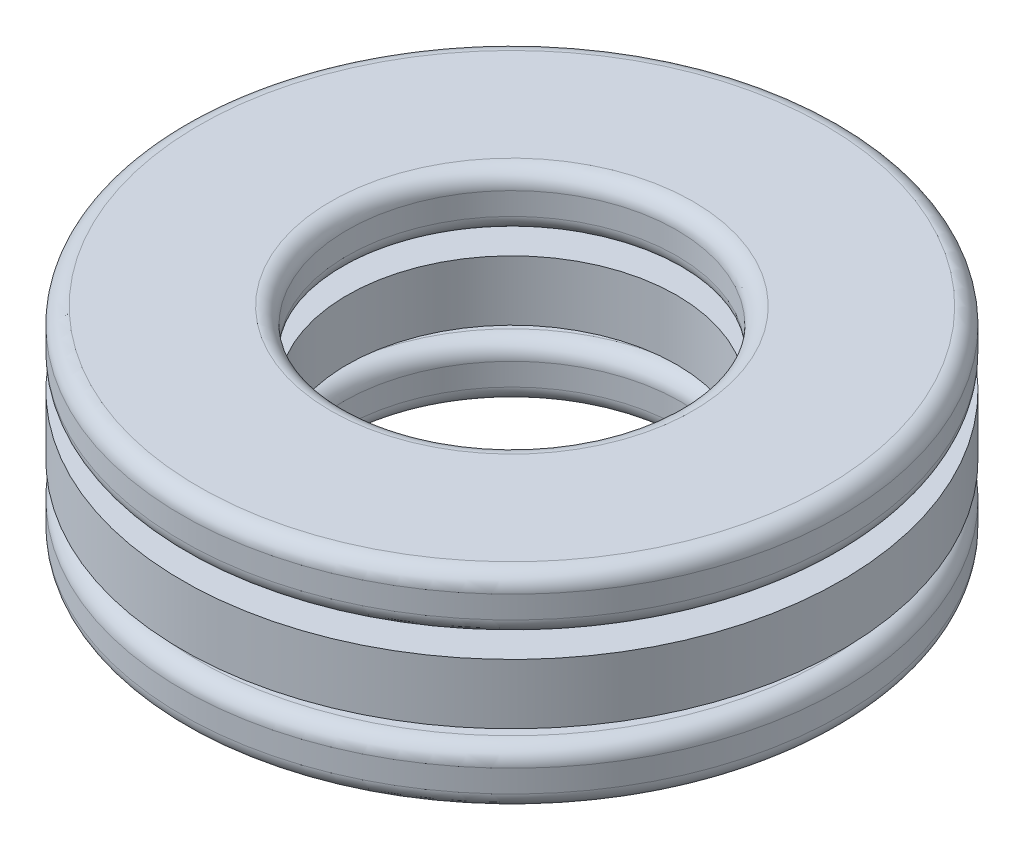
ISO-10303-21;
HEADER;
FILE_DESCRIPTION(('STEP AP214'),'2;1');
FILE_NAME('part.step','',(''),(''),'','','');
FILE_SCHEMA(('AUTOMOTIVE_DESIGN { 1 0 10303 214 1 1 1 1 }'));
ENDSEC;
DATA;
#1=APPLICATION_CONTEXT('core data for automotive mechanical design processes');
#2=APPLICATION_PROTOCOL_DEFINITION('international standard','automotive_design',2000,#1);
#3=PRODUCT_CONTEXT('',#1,'mechanical');
#4=PRODUCT('Part','Part','',(#3));
#5=PRODUCT_RELATED_PRODUCT_CATEGORY('part','',(#4));
#6=PRODUCT_DEFINITION_FORMATION('','',#4);
#7=PRODUCT_DEFINITION_CONTEXT('part definition',#1,'design');
#8=PRODUCT_DEFINITION('design','',#6,#7);
#9=PRODUCT_DEFINITION_SHAPE('','',#8);
#10=(LENGTH_UNIT() NAMED_UNIT(*) SI_UNIT(.MILLI.,.METRE.));
#11=(NAMED_UNIT(*) PLANE_ANGLE_UNIT() SI_UNIT($,.RADIAN.));
#12=(NAMED_UNIT(*) SI_UNIT($,.STERADIAN.) SOLID_ANGLE_UNIT());
#13=UNCERTAINTY_MEASURE_WITH_UNIT(LENGTH_MEASURE(1.E-05),#10,'distance_accuracy_value','');
#14=(GEOMETRIC_REPRESENTATION_CONTEXT(3) GLOBAL_UNCERTAINTY_ASSIGNED_CONTEXT((#13)) GLOBAL_UNIT_ASSIGNED_CONTEXT((#10,
#11,#12)) REPRESENTATION_CONTEXT('',''));
#15=CARTESIAN_POINT('',(0.,0.,0.));
#16=DIRECTION('',(0.,0.,1.));
#17=DIRECTION('',(1.,0.,0.));
#18=AXIS2_PLACEMENT_3D('',#15,#16,#17);
#19=CARTESIAN_POINT('',(0.,-1.55833333333333,0.));
#20=DIRECTION('',(0.,-1.,0.));
#21=DIRECTION('',(0.,0.,-1.));
#22=AXIS2_PLACEMENT_3D('',#19,#20,#21);
#23=TOROIDAL_SURFACE('',#22,4.5,0.4);
#24=CARTESIAN_POINT('',(0.,-1.15833333333333,0.));
#25=DIRECTION('',(0.,-1.,0.));
#26=DIRECTION('',(0.,0.,-1.));
#27=AXIS2_PLACEMENT_3D('',#24,#25,#26);
#28=CIRCLE('',#27,4.5);
#29=CARTESIAN_POINT('',(0.,-1.15833333333333,-4.5));
#30=VERTEX_POINT('',#29);
#31=EDGE_CURVE('E67',#30,#30,#28,.T.);
#32=ORIENTED_EDGE('',*,*,#31,.F.);
#33=EDGE_LOOP('',(#32));
#34=FACE_BOUND('',#33,.T.);
#35=CARTESIAN_POINT('',(0.,-1.55833333333333,0.));
#36=DIRECTION('',(0.,-1.,0.));
#37=DIRECTION('',(0.,0.,-1.));
#38=AXIS2_PLACEMENT_3D('',#35,#36,#37);
#39=CIRCLE('',#38,4.1);
#40=CARTESIAN_POINT('',(0.,-1.55833333333333,-4.1));
#41=VERTEX_POINT('',#40);
#42=EDGE_CURVE('E11',#41,#41,#39,.T.);
#43=ORIENTED_EDGE('',*,*,#42,.T.);
#44=EDGE_LOOP('',(#43));
#45=FACE_BOUND('',#44,.T.);
#46=ADVANCED_FACE('F39',(#34,#45),#23,.T.);
#47=CARTESIAN_POINT('',(0.,-3.5,0.));
#48=DIRECTION('',(0.,-1.,0.));
#49=DIRECTION('',(0.,0.,-1.));
#50=AXIS2_PLACEMENT_3D('',#47,#48,#49);
#51=CYLINDRICAL_SURFACE('',#50,4.1);
#52=ORIENTED_EDGE('',*,*,#42,.F.);
#53=EDGE_LOOP('',(#52));
#54=FACE_BOUND('',#53,.T.);
#55=CARTESIAN_POINT('',(0.,-2.1,0.));
#56=DIRECTION('',(0.,-1.,0.));
#57=DIRECTION('',(0.,0.,-1.));
#58=AXIS2_PLACEMENT_3D('',#55,#56,#57);
#59=CIRCLE('',#58,4.1);
#60=CARTESIAN_POINT('',(0.,-2.1,-4.1));
#61=VERTEX_POINT('',#60);
#62=EDGE_CURVE('E45',#61,#61,#59,.T.);
#63=ORIENTED_EDGE('',*,*,#62,.T.);
#64=EDGE_LOOP('',(#63));
#65=FACE_BOUND('',#64,.T.);
#66=ADVANCED_FACE('F74',(#54,#65),#51,.F.);
#67=CARTESIAN_POINT('',(0.,-2.1,0.));
#68=DIRECTION('',(0.,-1.,0.));
#69=DIRECTION('',(0.,0.,-1.));
#70=AXIS2_PLACEMENT_3D('',#67,#68,#69);
#71=TOROIDAL_SURFACE('',#70,4.5,0.400000000000002);
#72=ORIENTED_EDGE('',*,*,#62,.F.);
#73=EDGE_LOOP('',(#72));
#74=FACE_BOUND('',#73,.T.);
#75=CARTESIAN_POINT('',(0.,-2.5,0.));
#76=DIRECTION('',(0.,-1.,0.));
#77=DIRECTION('',(0.,0.,-1.));
#78=AXIS2_PLACEMENT_3D('',#75,#76,#77);
#79=CIRCLE('',#78,4.5);
#80=CARTESIAN_POINT('',(0.,-2.5,-4.5));
#81=VERTEX_POINT('',#80);
#82=EDGE_CURVE('E49',#81,#81,#79,.T.);
#83=ORIENTED_EDGE('',*,*,#82,.T.);
#84=EDGE_LOOP('',(#83));
#85=FACE_BOUND('',#84,.T.);
#86=ADVANCED_FACE('F78',(#74,#85),#71,.T.);
#87=CARTESIAN_POINT('',(0.,-2.5,7.6));
#88=DIRECTION('',(0.,1.,0.));
#89=DIRECTION('',(0.,0.,1.));
#90=AXIS2_PLACEMENT_3D('',#87,#88,#89);
#91=PLANE('',#90);
#92=ORIENTED_EDGE('',*,*,#82,.F.);
#93=EDGE_LOOP('',(#92));
#94=FACE_BOUND('',#93,.T.);
#95=CARTESIAN_POINT('',(0.,-2.5,0.));
#96=DIRECTION('',(0.,-1.,0.));
#97=DIRECTION('',(0.,0.,-1.));
#98=AXIS2_PLACEMENT_3D('',#95,#96,#97);
#99=CIRCLE('',#98,7.6);
#100=CARTESIAN_POINT('',(0.,-2.5,-7.6));
#101=VERTEX_POINT('',#100);
#102=EDGE_CURVE('E53',#101,#101,#99,.T.);
#103=ORIENTED_EDGE('',*,*,#102,.T.);
#104=EDGE_LOOP('',(#103));
#105=FACE_BOUND('',#104,.T.);
#106=ADVANCED_FACE('F83',(#94,#105),#91,.F.);
#107=CARTESIAN_POINT('',(0.,-2.1,0.));
#108=DIRECTION('',(0.,-1.,0.));
#109=DIRECTION('',(0.,0.,-1.));
#110=AXIS2_PLACEMENT_3D('',#107,#108,#109);
#111=TOROIDAL_SURFACE('',#110,7.6,0.400000000000001);
#112=ORIENTED_EDGE('',*,*,#102,.F.);
#113=EDGE_LOOP('',(#112));
#114=FACE_BOUND('',#113,.T.);
#115=CARTESIAN_POINT('',(0.,-2.1,0.));
#116=DIRECTION('',(0.,-1.,0.));
#117=DIRECTION('',(0.,0.,-1.));
#118=AXIS2_PLACEMENT_3D('',#115,#116,#117);
#119=CIRCLE('',#118,8.);
#120=CARTESIAN_POINT('',(0.,-2.1,-8.));
#121=VERTEX_POINT('',#120);
#122=EDGE_CURVE('E58',#121,#121,#119,.T.);
#123=ORIENTED_EDGE('',*,*,#122,.T.);
#124=EDGE_LOOP('',(#123));
#125=FACE_BOUND('',#124,.T.);
#126=ADVANCED_FACE('F89',(#114,#125),#111,.T.);
#127=CARTESIAN_POINT('',(0.,-3.5,0.));
#128=DIRECTION('',(0.,-1.,0.));
#129=DIRECTION('',(0.,0.,-1.));
#130=AXIS2_PLACEMENT_3D('',#127,#128,#129);
#131=CYLINDRICAL_SURFACE('',#130,8.);
#132=ORIENTED_EDGE('',*,*,#122,.F.);
#133=EDGE_LOOP('',(#132));
#134=FACE_BOUND('',#133,.T.);
#135=CARTESIAN_POINT('',(0.,-1.55833333333333,0.));
#136=DIRECTION('',(0.,-1.,0.));
#137=DIRECTION('',(0.,0.,-1.));
#138=AXIS2_PLACEMENT_3D('',#135,#136,#137);
#139=CIRCLE('',#138,8.);
#140=CARTESIAN_POINT('',(0.,-1.55833333333333,-8.));
#141=VERTEX_POINT('',#140);
#142=EDGE_CURVE('E61',#141,#141,#139,.T.);
#143=ORIENTED_EDGE('',*,*,#142,.T.);
#144=EDGE_LOOP('',(#143));
#145=FACE_BOUND('',#144,.T.);
#146=ADVANCED_FACE('F93',(#134,#145),#131,.T.);
#147=CARTESIAN_POINT('',(0.,-1.55833333333333,0.));
#148=DIRECTION('',(0.,-1.,0.));
#149=DIRECTION('',(0.,0.,-1.));
#150=AXIS2_PLACEMENT_3D('',#147,#148,#149);
#151=TOROIDAL_SURFACE('',#150,7.6,0.4);
#152=ORIENTED_EDGE('',*,*,#142,.F.);
#153=EDGE_LOOP('',(#152));
#154=FACE_BOUND('',#153,.T.);
#155=CARTESIAN_POINT('',(0.,-1.15833333333333,0.));
#156=DIRECTION('',(0.,-1.,0.));
#157=DIRECTION('',(0.,0.,-1.));
#158=AXIS2_PLACEMENT_3D('',#155,#156,#157);
#159=CIRCLE('',#158,7.6);
#160=CARTESIAN_POINT('',(0.,-1.15833333333333,-7.6));
#161=VERTEX_POINT('',#160);
#162=EDGE_CURVE('E64',#161,#161,#159,.T.);
#163=ORIENTED_EDGE('',*,*,#162,.T.);
#164=EDGE_LOOP('',(#163));
#165=FACE_BOUND('',#164,.T.);
#166=ADVANCED_FACE('F97',(#154,#165),#151,.T.);
#167=CARTESIAN_POINT('',(0.,-1.15833333333333,7.6));
#168=DIRECTION('',(0.,-1.,0.));
#169=DIRECTION('',(0.,0.,-1.));
#170=AXIS2_PLACEMENT_3D('',#167,#168,#169);
#171=PLANE('',#170);
#172=ORIENTED_EDGE('',*,*,#162,.F.);
#173=EDGE_LOOP('',(#172));
#174=FACE_BOUND('',#173,.T.);
#175=ORIENTED_EDGE('',*,*,#31,.T.);
#176=EDGE_LOOP('',(#175));
#177=FACE_BOUND('',#176,.T.);
#178=ADVANCED_FACE('F71',(#174,#177),#171,.F.);
#179=CLOSED_SHELL('',(#46,#66,#86,#106,#126,#146,#166,#178));
#180=MANIFOLD_SOLID_BREP('B2',#179);
#181=CARTESIAN_POINT('',(0.,1.55833333333333,0.));
#182=DIRECTION('',(0.,-1.,0.));
#183=DIRECTION('',(0.,0.,-1.));
#184=AXIS2_PLACEMENT_3D('',#181,#182,#183);
#185=TOROIDAL_SURFACE('',#184,4.4,0.400000000000001);
#186=CARTESIAN_POINT('',(0.,1.55833333333333,0.));
#187=DIRECTION('',(0.,-1.,0.));
#188=DIRECTION('',(0.,0.,-1.));
#189=AXIS2_PLACEMENT_3D('',#186,#187,#188);
#190=CIRCLE('',#189,4.);
#191=CARTESIAN_POINT('',(0.,1.55833333333333,-4.));
#192=VERTEX_POINT('',#191);
#193=EDGE_CURVE('E38',#192,#192,#190,.T.);
#194=ORIENTED_EDGE('',*,*,#193,.F.);
#195=EDGE_LOOP('',(#194));
#196=FACE_BOUND('',#195,.T.);
#197=CARTESIAN_POINT('',(0.,1.15833333333333,0.));
#198=DIRECTION('',(0.,-1.,0.));
#199=DIRECTION('',(0.,0.,-1.));
#200=AXIS2_PLACEMENT_3D('',#197,#198,#199);
#201=CIRCLE('',#200,4.4);
#202=CARTESIAN_POINT('',(0.,1.15833333333333,-4.4));
#203=VERTEX_POINT('',#202);
#204=EDGE_CURVE('E194',#203,#203,#201,.T.);
#205=ORIENTED_EDGE('',*,*,#204,.T.);
#206=EDGE_LOOP('',(#205));
#207=FACE_BOUND('',#206,.T.);
#208=ADVANCED_FACE('F166',(#196,#207),#185,.T.);
#209=CARTESIAN_POINT('',(0.,-3.5,0.));
#210=DIRECTION('',(0.,-1.,0.));
#211=DIRECTION('',(0.,0.,-1.));
#212=AXIS2_PLACEMENT_3D('',#209,#210,#211);
#213=CYLINDRICAL_SURFACE('',#212,4.);
#214=CARTESIAN_POINT('',(0.,2.1,0.));
#215=DIRECTION('',(0.,-1.,0.));
#216=DIRECTION('',(0.,0.,-1.));
#217=AXIS2_PLACEMENT_3D('',#214,#215,#216);
#218=CIRCLE('',#217,4.);
#219=CARTESIAN_POINT('',(0.,2.1,-4.));
#220=VERTEX_POINT('',#219);
#221=EDGE_CURVE('E172',#220,#220,#218,.T.);
#222=ORIENTED_EDGE('',*,*,#221,.F.);
#223=EDGE_LOOP('',(#222));
#224=FACE_BOUND('',#223,.T.);
#225=ORIENTED_EDGE('',*,*,#193,.T.);
#226=EDGE_LOOP('',(#225));
#227=FACE_BOUND('',#226,.T.);
#228=ADVANCED_FACE('F231',(#224,#227),#213,.F.);
#229=CARTESIAN_POINT('',(0.,2.1,0.));
#230=DIRECTION('',(0.,-1.,0.));
#231=DIRECTION('',(0.,0.,-1.));
#232=AXIS2_PLACEMENT_3D('',#229,#230,#231);
#233=TOROIDAL_SURFACE('',#232,4.4,0.4);
#234=CARTESIAN_POINT('',(0.,2.5,0.));
#235=DIRECTION('',(0.,-1.,0.));
#236=DIRECTION('',(0.,0.,-1.));
#237=AXIS2_PLACEMENT_3D('',#234,#235,#236);
#238=CIRCLE('',#237,4.4);
#239=CARTESIAN_POINT('',(0.,2.5,-4.4));
#240=VERTEX_POINT('',#239);
#241=EDGE_CURVE('E176',#240,#240,#238,.T.);
#242=ORIENTED_EDGE('',*,*,#241,.F.);
#243=EDGE_LOOP('',(#242));
#244=FACE_BOUND('',#243,.T.);
#245=ORIENTED_EDGE('',*,*,#221,.T.);
#246=EDGE_LOOP('',(#245));
#247=FACE_BOUND('',#246,.T.);
#248=ADVANCED_FACE('F226',(#244,#247),#233,.T.);
#249=CARTESIAN_POINT('',(0.,2.5,7.6));
#250=DIRECTION('',(0.,-1.,0.));
#251=DIRECTION('',(0.,0.,-1.));
#252=AXIS2_PLACEMENT_3D('',#249,#250,#251);
#253=PLANE('',#252);
#254=CARTESIAN_POINT('',(0.,2.5,0.));
#255=DIRECTION('',(0.,-1.,0.));
#256=DIRECTION('',(0.,0.,-1.));
#257=AXIS2_PLACEMENT_3D('',#254,#255,#256);
#258=CIRCLE('',#257,7.6);
#259=CARTESIAN_POINT('',(0.,2.5,-7.6));
#260=VERTEX_POINT('',#259);
#261=EDGE_CURVE('E180',#260,#260,#258,.T.);
#262=ORIENTED_EDGE('',*,*,#261,.F.);
#263=EDGE_LOOP('',(#262));
#264=FACE_BOUND('',#263,.T.);
#265=ORIENTED_EDGE('',*,*,#241,.T.);
#266=EDGE_LOOP('',(#265));
#267=FACE_BOUND('',#266,.T.);
#268=ADVANCED_FACE('F220',(#264,#267),#253,.F.);
#269=CARTESIAN_POINT('',(0.,2.1,0.));
#270=DIRECTION('',(0.,-1.,0.));
#271=DIRECTION('',(0.,0.,-1.));
#272=AXIS2_PLACEMENT_3D('',#269,#270,#271);
#273=TOROIDAL_SURFACE('',#272,7.6,0.400000000000001);
#274=CARTESIAN_POINT('',(0.,2.1,0.));
#275=DIRECTION('',(0.,-1.,0.));
#276=DIRECTION('',(0.,0.,-1.));
#277=AXIS2_PLACEMENT_3D('',#274,#275,#276);
#278=CIRCLE('',#277,8.);
#279=CARTESIAN_POINT('',(0.,2.1,-8.));
#280=VERTEX_POINT('',#279);
#281=EDGE_CURVE('E185',#280,#280,#278,.T.);
#282=ORIENTED_EDGE('',*,*,#281,.F.);
#283=EDGE_LOOP('',(#282));
#284=FACE_BOUND('',#283,.T.);
#285=ORIENTED_EDGE('',*,*,#261,.T.);
#286=EDGE_LOOP('',(#285));
#287=FACE_BOUND('',#286,.T.);
#288=ADVANCED_FACE('F214',(#284,#287),#273,.T.);
#289=CARTESIAN_POINT('',(0.,-3.5,0.));
#290=DIRECTION('',(0.,-1.,0.));
#291=DIRECTION('',(0.,0.,-1.));
#292=AXIS2_PLACEMENT_3D('',#289,#290,#291);
#293=CYLINDRICAL_SURFACE('',#292,8.);
#294=CARTESIAN_POINT('',(0.,1.55833333333333,0.));
#295=DIRECTION('',(0.,-1.,0.));
#296=DIRECTION('',(0.,0.,-1.));
#297=AXIS2_PLACEMENT_3D('',#294,#295,#296);
#298=CIRCLE('',#297,8.);
#299=CARTESIAN_POINT('',(0.,1.55833333333333,-8.));
#300=VERTEX_POINT('',#299);
#301=EDGE_CURVE('E188',#300,#300,#298,.T.);
#302=ORIENTED_EDGE('',*,*,#301,.F.);
#303=EDGE_LOOP('',(#302));
#304=FACE_BOUND('',#303,.T.);
#305=ORIENTED_EDGE('',*,*,#281,.T.);
#306=EDGE_LOOP('',(#305));
#307=FACE_BOUND('',#306,.T.);
#308=ADVANCED_FACE('F208',(#304,#307),#293,.T.);
#309=CARTESIAN_POINT('',(0.,1.55833333333333,0.));
#310=DIRECTION('',(0.,-1.,0.));
#311=DIRECTION('',(0.,0.,-1.));
#312=AXIS2_PLACEMENT_3D('',#309,#310,#311);
#313=TOROIDAL_SURFACE('',#312,7.6,0.4);
#314=CARTESIAN_POINT('',(0.,1.15833333333333,0.));
#315=DIRECTION('',(0.,-1.,0.));
#316=DIRECTION('',(0.,0.,-1.));
#317=AXIS2_PLACEMENT_3D('',#314,#315,#316);
#318=CIRCLE('',#317,7.6);
#319=CARTESIAN_POINT('',(0.,1.15833333333333,-7.6));
#320=VERTEX_POINT('',#319);
#321=EDGE_CURVE('E191',#320,#320,#318,.T.);
#322=ORIENTED_EDGE('',*,*,#321,.F.);
#323=EDGE_LOOP('',(#322));
#324=FACE_BOUND('',#323,.T.);
#325=ORIENTED_EDGE('',*,*,#301,.T.);
#326=EDGE_LOOP('',(#325));
#327=FACE_BOUND('',#326,.T.);
#328=ADVANCED_FACE('F202',(#324,#327),#313,.T.);
#329=CARTESIAN_POINT('',(0.,1.15833333333333,7.6));
#330=DIRECTION('',(0.,1.,0.));
#331=DIRECTION('',(0.,0.,1.));
#332=AXIS2_PLACEMENT_3D('',#329,#330,#331);
#333=PLANE('',#332);
#334=ORIENTED_EDGE('',*,*,#204,.F.);
#335=EDGE_LOOP('',(#334));
#336=FACE_BOUND('',#335,.T.);
#337=ORIENTED_EDGE('',*,*,#321,.T.);
#338=EDGE_LOOP('',(#337));
#339=FACE_BOUND('',#338,.T.);
#340=ADVANCED_FACE('F199',(#336,#339),#333,.F.);
#341=CLOSED_SHELL('',(#208,#228,#248,#268,#288,#308,#328,#340));
#342=MANIFOLD_SOLID_BREP('B6',#341);
#343=CARTESIAN_POINT('',(-5.1961524227066,0.,3.00000000000006));
#344=DIRECTION('',(0.,1.,0.));
#345=DIRECTION('',(0.866025403784433,0.,-0.50000000000001));
#346=AXIS2_PLACEMENT_3D('',#343,#344,#345);
#347=SPHERICAL_SURFACE('',#346,1.16666666666667);
#348=CARTESIAN_POINT('',(-5.1961524227066,1.16666666666667,3.00000000000006));
#349=VERTEX_POINT('',#348);
#350=VERTEX_LOOP('',#349);
#351=FACE_BOUND('',#350,.T.);
#352=ADVANCED_FACE('F293',(#351),#347,.T.);
#353=CLOSED_SHELL('',(#352));
#354=MANIFOLD_SOLID_BREP('B33',#353);
#355=CARTESIAN_POINT('',(-5.19615242270666,0.,-2.99999999999995));
#356=DIRECTION('',(0.,1.,0.));
#357=DIRECTION('',(0.866025403784443,0.,0.499999999999992));
#358=AXIS2_PLACEMENT_3D('',#355,#356,#357);
#359=SPHERICAL_SURFACE('',#358,1.16666666666667);
#360=CARTESIAN_POINT('',(-5.19615242270666,1.16666666666667,-2.99999999999995));
#361=VERTEX_POINT('',#360);
#362=VERTEX_LOOP('',#361);
#363=FACE_BOUND('',#362,.T.);
#364=ADVANCED_FACE('F311',(#363),#359,.T.);
#365=CLOSED_SHELL('',(#364));
#366=MANIFOLD_SOLID_BREP('B162',#365);
#367=CARTESIAN_POINT('',(0.,0.,-6.));
#368=DIRECTION('',(0.,1.,0.));
#369=DIRECTION('',(0.,0.,1.));
#370=AXIS2_PLACEMENT_3D('',#367,#368,#369);
#371=SPHERICAL_SURFACE('',#370,1.16666666666667);
#372=CARTESIAN_POINT('',(0.,1.16666666666667,-6.));
#373=VERTEX_POINT('',#372);
#374=VERTEX_LOOP('',#373);
#375=FACE_BOUND('',#374,.T.);
#376=ADVANCED_FACE('F329',(#375),#371,.T.);
#377=CLOSED_SHELL('',(#376));
#378=MANIFOLD_SOLID_BREP('B289',#377);
#379=CARTESIAN_POINT('',(5.19615242270662,0.,-3.00000000000003));
#380=DIRECTION('',(0.,1.,0.));
#381=DIRECTION('',(-0.866025403784436,0.,0.500000000000004));
#382=AXIS2_PLACEMENT_3D('',#379,#380,#381);
#383=SPHERICAL_SURFACE('',#382,1.16666666666667);
#384=CARTESIAN_POINT('',(5.19615242270662,1.16666666666667,-3.00000000000003));
#385=VERTEX_POINT('',#384);
#386=VERTEX_LOOP('',#385);
#387=FACE_BOUND('',#386,.T.);
#388=ADVANCED_FACE('F347',(#387),#383,.T.);
#389=CLOSED_SHELL('',(#388));
#390=MANIFOLD_SOLID_BREP('B307',#389);
#391=CARTESIAN_POINT('',(5.19615242270664,0.,2.99999999999999));
#392=DIRECTION('',(0.,1.,0.));
#393=DIRECTION('',(-0.86602540378444,0.,-0.499999999999998));
#394=AXIS2_PLACEMENT_3D('',#391,#392,#393);
#395=SPHERICAL_SURFACE('',#394,1.16666666666667);
#396=CARTESIAN_POINT('',(5.19615242270664,1.16666666666667,2.99999999999999));
#397=VERTEX_POINT('',#396);
#398=VERTEX_LOOP('',#397);
#399=FACE_BOUND('',#398,.T.);
#400=ADVANCED_FACE('F365',(#399),#395,.T.);
#401=CLOSED_SHELL('',(#400));
#402=MANIFOLD_SOLID_BREP('B325',#401);
#403=CARTESIAN_POINT('',(0.,0.,6.));
#404=DIRECTION('',(0.,1.,0.));
#405=DIRECTION('',(0.,0.,-1.));
#406=AXIS2_PLACEMENT_3D('',#403,#404,#405);
#407=SPHERICAL_SURFACE('',#406,1.16666666666667);
#408=CARTESIAN_POINT('',(0.,1.16666666666667,6.));
#409=VERTEX_POINT('',#408);
#410=VERTEX_LOOP('',#409);
#411=FACE_BOUND('',#410,.T.);
#412=ADVANCED_FACE('F384',(#411),#407,.T.);
#413=CLOSED_SHELL('',(#412));
#414=MANIFOLD_SOLID_BREP('B343',#413);
#415=CARTESIAN_POINT('',(0.,-3.5,0.));
#416=DIRECTION('',(0.,-1.,0.));
#417=DIRECTION('',(0.,0.,-1.));
#418=AXIS2_PLACEMENT_3D('',#415,#416,#417);
#419=CYLINDRICAL_SURFACE('',#418,8.);
#420=CARTESIAN_POINT('',(0.,-0.729166666666667,0.));
#421=DIRECTION('',(0.,-1.,0.));
#422=DIRECTION('',(0.,0.,-1.));
#423=AXIS2_PLACEMENT_3D('',#420,#421,#422);
#424=CIRCLE('',#423,8.);
#425=CARTESIAN_POINT('',(0.,-0.729166666666667,-8.));
#426=VERTEX_POINT('',#425);
#427=EDGE_CURVE('E383',#426,#426,#424,.T.);
#428=ORIENTED_EDGE('',*,*,#427,.F.);
#429=EDGE_LOOP('',(#428));
#430=FACE_BOUND('',#429,.T.);
#431=CARTESIAN_POINT('',(0.,0.729166666666666,0.));
#432=DIRECTION('',(0.,-1.,0.));
#433=DIRECTION('',(0.,0.,-1.));
#434=AXIS2_PLACEMENT_3D('',#431,#432,#433);
#435=CIRCLE('',#434,8.);
#436=CARTESIAN_POINT('',(0.,0.729166666666666,-8.));
#437=VERTEX_POINT('',#436);
#438=EDGE_CURVE('E412',#437,#437,#435,.T.);
#439=ORIENTED_EDGE('',*,*,#438,.T.);
#440=EDGE_LOOP('',(#439));
#441=FACE_BOUND('',#440,.T.);
#442=ADVANCED_FACE('F396',(#430,#441),#419,.T.);
#443=CARTESIAN_POINT('',(0.,-0.729166666666667,8.));
#444=DIRECTION('',(0.,1.,0.));
#445=DIRECTION('',(0.,0.,1.));
#446=AXIS2_PLACEMENT_3D('',#443,#444,#445);
#447=PLANE('',#446);
#448=CARTESIAN_POINT('',(-5.1961524227066,-0.729166666666667,3.00000000000006));
#449=DIRECTION('',(0.,1.,0.));
#450=DIRECTION('',(-0.866025403784433,0.,0.50000000000001));
#451=AXIS2_PLACEMENT_3D('',#448,#449,#450);
#452=CIRCLE('',#451,0.910728874766433);
#453=CARTESIAN_POINT('',(-5.98486676421434,-0.729166666666667,3.45536443738329));
#454=VERTEX_POINT('',#453);
#455=EDGE_CURVE('E442',#454,#454,#452,.T.);
#456=ORIENTED_EDGE('',*,*,#455,.T.);
#457=EDGE_LOOP('',(#456));
#458=FACE_BOUND('',#457,.T.);
#459=CARTESIAN_POINT('',(-5.19615242270666,-0.729166666666667,-2.99999999999995));
#460=DIRECTION('',(0.,1.,0.));
#461=DIRECTION('',(-0.866025403784443,0.,-0.499999999999992));
#462=AXIS2_PLACEMENT_3D('',#459,#460,#461);
#463=CIRCLE('',#462,0.910728874766433);
#464=CARTESIAN_POINT('',(-5.98486676421441,-0.729166666666667,-3.45536443738316));
#465=VERTEX_POINT('',#464);
#466=EDGE_CURVE('E436',#465,#465,#463,.T.);
#467=ORIENTED_EDGE('',*,*,#466,.T.);
#468=EDGE_LOOP('',(#467));
#469=FACE_BOUND('',#468,.T.);
#470=CARTESIAN_POINT('',(0.,-0.729166666666667,-6.));
#471=DIRECTION('',(0.,1.,0.));
#472=DIRECTION('',(0.,0.,-1.));
#473=AXIS2_PLACEMENT_3D('',#470,#471,#472);
#474=CIRCLE('',#473,0.910728874766433);
#475=CARTESIAN_POINT('',(0.,-0.729166666666667,-6.91072887476643));
#476=VERTEX_POINT('',#475);
#477=EDGE_CURVE('E430',#476,#476,#474,.T.);
#478=ORIENTED_EDGE('',*,*,#477,.T.);
#479=EDGE_LOOP('',(#478));
#480=FACE_BOUND('',#479,.T.);
#481=CARTESIAN_POINT('',(5.19615242270662,-0.729166666666667,-3.00000000000003));
#482=DIRECTION('',(0.,1.,0.));
#483=DIRECTION('',(0.866025403784436,0.,-0.500000000000004));
#484=AXIS2_PLACEMENT_3D('',#481,#482,#483);
#485=CIRCLE('',#484,0.910728874766433);
#486=CARTESIAN_POINT('',(5.98486676421436,-0.729166666666667,-3.45536443738325));
#487=VERTEX_POINT('',#486);
#488=EDGE_CURVE('E424',#487,#487,#485,.T.);
#489=ORIENTED_EDGE('',*,*,#488,.T.);
#490=EDGE_LOOP('',(#489));
#491=FACE_BOUND('',#490,.T.);
#492=CARTESIAN_POINT('',(5.19615242270664,-0.729166666666667,2.99999999999999));
#493=DIRECTION('',(0.,1.,0.));
#494=DIRECTION('',(0.86602540378444,0.,0.499999999999998));
#495=AXIS2_PLACEMENT_3D('',#492,#493,#494);
#496=CIRCLE('',#495,0.910728874766433);
#497=CARTESIAN_POINT('',(5.98486676421439,-0.729166666666667,3.4553644373832));
#498=VERTEX_POINT('',#497);
#499=EDGE_CURVE('E418',#498,#498,#496,.T.);
#500=ORIENTED_EDGE('',*,*,#499,.T.);
#501=EDGE_LOOP('',(#500));
#502=FACE_BOUND('',#501,.T.);
#503=CARTESIAN_POINT('',(0.,-0.729166666666667,6.));
#504=DIRECTION('',(0.,1.,0.));
#505=DIRECTION('',(0.,0.,1.));
#506=AXIS2_PLACEMENT_3D('',#503,#504,#505);
#507=CIRCLE('',#506,0.910728874766433);
#508=CARTESIAN_POINT('',(0.,-0.729166666666667,6.91072887476643));
#509=VERTEX_POINT('',#508);
#510=EDGE_CURVE('E415',#509,#509,#507,.T.);
#511=ORIENTED_EDGE('',*,*,#510,.T.);
#512=EDGE_LOOP('',(#511));
#513=FACE_BOUND('',#512,.T.);
#514=CARTESIAN_POINT('',(0.,-0.729166666666667,0.));
#515=DIRECTION('',(0.,-1.,0.));
#516=DIRECTION('',(0.,0.,-1.));
#517=AXIS2_PLACEMENT_3D('',#514,#515,#516);
#518=CIRCLE('',#517,4.);
#519=CARTESIAN_POINT('',(0.,-0.729166666666667,-4.));
#520=VERTEX_POINT('',#519);
#521=EDGE_CURVE('E403',#520,#520,#518,.T.);
#522=ORIENTED_EDGE('',*,*,#521,.F.);
#523=EDGE_LOOP('',(#522));
#524=FACE_BOUND('',#523,.T.);
#525=ORIENTED_EDGE('',*,*,#427,.T.);
#526=EDGE_LOOP('',(#525));
#527=FACE_BOUND('',#526,.T.);
#528=ADVANCED_FACE('F459',(#458,#469,#480,#491,#502,#513,#524,#527),#447,.F.);
#529=CARTESIAN_POINT('',(0.,-3.5,0.));
#530=DIRECTION('',(0.,-1.,0.));
#531=DIRECTION('',(0.,0.,-1.));
#532=AXIS2_PLACEMENT_3D('',#529,#530,#531);
#533=CYLINDRICAL_SURFACE('',#532,4.);
#534=CARTESIAN_POINT('',(0.,0.729166666666666,0.));
#535=DIRECTION('',(0.,-1.,0.));
#536=DIRECTION('',(0.,0.,-1.));
#537=AXIS2_PLACEMENT_3D('',#534,#535,#536);
#538=CIRCLE('',#537,4.);
#539=CARTESIAN_POINT('',(0.,0.729166666666666,-4.));
#540=VERTEX_POINT('',#539);
#541=EDGE_CURVE('E407',#540,#540,#538,.T.);
#542=ORIENTED_EDGE('',*,*,#541,.F.);
#543=EDGE_LOOP('',(#542));
#544=FACE_BOUND('',#543,.T.);
#545=ORIENTED_EDGE('',*,*,#521,.T.);
#546=EDGE_LOOP('',(#545));
#547=FACE_BOUND('',#546,.T.);
#548=ADVANCED_FACE('F462',(#544,#547),#533,.F.);
#549=CARTESIAN_POINT('',(0.,0.729166666666666,8.));
#550=DIRECTION('',(0.,-1.,0.));
#551=DIRECTION('',(0.,0.,-1.));
#552=AXIS2_PLACEMENT_3D('',#549,#550,#551);
#553=PLANE('',#552);
#554=CARTESIAN_POINT('',(-5.1961524227066,0.729166666666666,3.00000000000006));
#555=DIRECTION('',(0.,-1.,0.));
#556=DIRECTION('',(0.866025403784433,0.,-0.50000000000001));
#557=AXIS2_PLACEMENT_3D('',#554,#555,#556);
#558=CIRCLE('',#557,0.910728874766434);
#559=CARTESIAN_POINT('',(-4.40743808119885,0.729166666666666,2.54463556261683));
#560=VERTEX_POINT('',#559);
#561=EDGE_CURVE('E445',#560,#560,#558,.T.);
#562=ORIENTED_EDGE('',*,*,#561,.T.);
#563=EDGE_LOOP('',(#562));
#564=FACE_BOUND('',#563,.T.);
#565=CARTESIAN_POINT('',(-5.19615242270666,0.729166666666666,-2.99999999999995));
#566=DIRECTION('',(0.,-1.,0.));
#567=DIRECTION('',(0.866025403784443,0.,0.499999999999992));
#568=AXIS2_PLACEMENT_3D('',#565,#566,#567);
#569=CIRCLE('',#568,0.910728874766434);
#570=CARTESIAN_POINT('',(-4.40743808119891,0.729166666666666,-2.54463556261674));
#571=VERTEX_POINT('',#570);
#572=EDGE_CURVE('E439',#571,#571,#569,.T.);
#573=ORIENTED_EDGE('',*,*,#572,.T.);
#574=EDGE_LOOP('',(#573));
#575=FACE_BOUND('',#574,.T.);
#576=CARTESIAN_POINT('',(0.,0.729166666666666,-6.));
#577=DIRECTION('',(0.,-1.,0.));
#578=DIRECTION('',(0.,0.,1.));
#579=AXIS2_PLACEMENT_3D('',#576,#577,#578);
#580=CIRCLE('',#579,0.910728874766434);
#581=CARTESIAN_POINT('',(0.,0.729166666666666,-5.08927112523357));
#582=VERTEX_POINT('',#581);
#583=EDGE_CURVE('E433',#582,#582,#580,.T.);
#584=ORIENTED_EDGE('',*,*,#583,.T.);
#585=EDGE_LOOP('',(#584));
#586=FACE_BOUND('',#585,.T.);
#587=CARTESIAN_POINT('',(5.19615242270662,0.729166666666666,-3.00000000000003));
#588=DIRECTION('',(0.,-1.,0.));
#589=DIRECTION('',(-0.866025403784436,0.,0.500000000000004));
#590=AXIS2_PLACEMENT_3D('',#587,#588,#589);
#591=CIRCLE('',#590,0.910728874766434);
#592=CARTESIAN_POINT('',(4.40743808119887,0.729166666666666,-2.5446355626168));
#593=VERTEX_POINT('',#592);
#594=EDGE_CURVE('E427',#593,#593,#591,.T.);
#595=ORIENTED_EDGE('',*,*,#594,.T.);
#596=EDGE_LOOP('',(#595));
#597=FACE_BOUND('',#596,.T.);
#598=CARTESIAN_POINT('',(5.19615242270664,0.729166666666666,2.99999999999999));
#599=DIRECTION('',(0.,-1.,0.));
#600=DIRECTION('',(-0.86602540378444,0.,-0.499999999999998));
#601=AXIS2_PLACEMENT_3D('',#598,#599,#600);
#602=CIRCLE('',#601,0.910728874766434);
#603=CARTESIAN_POINT('',(4.40743808119889,0.729166666666666,2.54463556261677));
#604=VERTEX_POINT('',#603);
#605=EDGE_CURVE('E421',#604,#604,#602,.T.);
#606=ORIENTED_EDGE('',*,*,#605,.T.);
#607=EDGE_LOOP('',(#606));
#608=FACE_BOUND('',#607,.T.);
#609=CARTESIAN_POINT('',(0.,0.729166666666666,6.));
#610=DIRECTION('',(0.,-1.,0.));
#611=DIRECTION('',(0.,0.,-1.));
#612=AXIS2_PLACEMENT_3D('',#609,#610,#611);
#613=CIRCLE('',#612,0.910728874766434);
#614=CARTESIAN_POINT('',(0.,0.729166666666666,5.08927112523357));
#615=VERTEX_POINT('',#614);
#616=EDGE_CURVE('E399',#615,#615,#613,.T.);
#617=ORIENTED_EDGE('',*,*,#616,.T.);
#618=EDGE_LOOP('',(#617));
#619=FACE_BOUND('',#618,.T.);
#620=ORIENTED_EDGE('',*,*,#438,.F.);
#621=EDGE_LOOP('',(#620));
#622=FACE_BOUND('',#621,.T.);
#623=ORIENTED_EDGE('',*,*,#541,.T.);
#624=EDGE_LOOP('',(#623));
#625=FACE_BOUND('',#624,.T.);
#626=ADVANCED_FACE('F449',(#564,#575,#586,#597,#608,#619,#622,#625),#553,.F.);
#627=CARTESIAN_POINT('',(0.,0.,6.));
#628=DIRECTION('',(0.,1.,0.));
#629=DIRECTION('',(0.,0.,-1.));
#630=AXIS2_PLACEMENT_3D('',#627,#628,#629);
#631=SPHERICAL_SURFACE('',#630,1.16666666666667);
#632=ORIENTED_EDGE('',*,*,#616,.F.);
#633=EDGE_LOOP('',(#632));
#634=FACE_BOUND('',#633,.T.);
#635=ORIENTED_EDGE('',*,*,#510,.F.);
#636=EDGE_LOOP('',(#635));
#637=FACE_BOUND('',#636,.T.);
#638=ADVANCED_FACE('F481',(#634,#637),#631,.F.);
#639=CARTESIAN_POINT('',(5.19615242270664,0.,2.99999999999999));
#640=DIRECTION('',(0.,1.,0.));
#641=DIRECTION('',(-0.86602540378444,0.,-0.499999999999998));
#642=AXIS2_PLACEMENT_3D('',#639,#640,#641);
#643=SPHERICAL_SURFACE('',#642,1.16666666666667);
#644=ORIENTED_EDGE('',*,*,#605,.F.);
#645=EDGE_LOOP('',(#644));
#646=FACE_BOUND('',#645,.T.);
#647=ORIENTED_EDGE('',*,*,#499,.F.);
#648=EDGE_LOOP('',(#647));
#649=FACE_BOUND('',#648,.T.);
#650=ADVANCED_FACE('F512',(#646,#649),#643,.F.);
#651=CARTESIAN_POINT('',(5.19615242270662,0.,-3.00000000000003));
#652=DIRECTION('',(0.,1.,0.));
#653=DIRECTION('',(-0.866025403784436,0.,0.500000000000004));
#654=AXIS2_PLACEMENT_3D('',#651,#652,#653);
#655=SPHERICAL_SURFACE('',#654,1.16666666666667);
#656=ORIENTED_EDGE('',*,*,#594,.F.);
#657=EDGE_LOOP('',(#656));
#658=FACE_BOUND('',#657,.T.);
#659=ORIENTED_EDGE('',*,*,#488,.F.);
#660=EDGE_LOOP('',(#659));
#661=FACE_BOUND('',#660,.T.);
#662=ADVANCED_FACE('F517',(#658,#661),#655,.F.);
#663=CARTESIAN_POINT('',(0.,0.,-6.));
#664=DIRECTION('',(0.,1.,0.));
#665=DIRECTION('',(0.,0.,1.));
#666=AXIS2_PLACEMENT_3D('',#663,#664,#665);
#667=SPHERICAL_SURFACE('',#666,1.16666666666667);
#668=ORIENTED_EDGE('',*,*,#583,.F.);
#669=EDGE_LOOP('',(#668));
#670=FACE_BOUND('',#669,.T.);
#671=ORIENTED_EDGE('',*,*,#477,.F.);
#672=EDGE_LOOP('',(#671));
#673=FACE_BOUND('',#672,.T.);
#674=ADVANCED_FACE('F527',(#670,#673),#667,.F.);
#675=CARTESIAN_POINT('',(-5.19615242270666,0.,-2.99999999999995));
#676=DIRECTION('',(0.,1.,0.));
#677=DIRECTION('',(0.866025403784443,0.,0.499999999999992));
#678=AXIS2_PLACEMENT_3D('',#675,#676,#677);
#679=SPHERICAL_SURFACE('',#678,1.16666666666667);
#680=ORIENTED_EDGE('',*,*,#572,.F.);
#681=EDGE_LOOP('',(#680));
#682=FACE_BOUND('',#681,.T.);
#683=ORIENTED_EDGE('',*,*,#466,.F.);
#684=EDGE_LOOP('',(#683));
#685=FACE_BOUND('',#684,.T.);
#686=ADVANCED_FACE('F455',(#682,#685),#679,.F.);
#687=CARTESIAN_POINT('',(-5.1961524227066,0.,3.00000000000006));
#688=DIRECTION('',(0.,1.,0.));
#689=DIRECTION('',(0.866025403784433,0.,-0.50000000000001));
#690=AXIS2_PLACEMENT_3D('',#687,#688,#689);
#691=SPHERICAL_SURFACE('',#690,1.16666666666667);
#692=ORIENTED_EDGE('',*,*,#561,.F.);
#693=EDGE_LOOP('',(#692));
#694=FACE_BOUND('',#693,.T.);
#695=ORIENTED_EDGE('',*,*,#455,.F.);
#696=EDGE_LOOP('',(#695));
#697=FACE_BOUND('',#696,.T.);
#698=ADVANCED_FACE('F452',(#694,#697),#691,.F.);
#699=CLOSED_SHELL('',(#442,#528,#548,#626,#638,#650,#662,#674,#686,#698));
#700=MANIFOLD_SOLID_BREP('B361',#699);
#701=ADVANCED_BREP_SHAPE_REPRESENTATION('',(#18,#180,#342,#354,#366,#378,#390,#402,#414,#700),#14);
#702=SHAPE_DEFINITION_REPRESENTATION(#9,#701);
ENDSEC;
END-ISO-10303-21;
